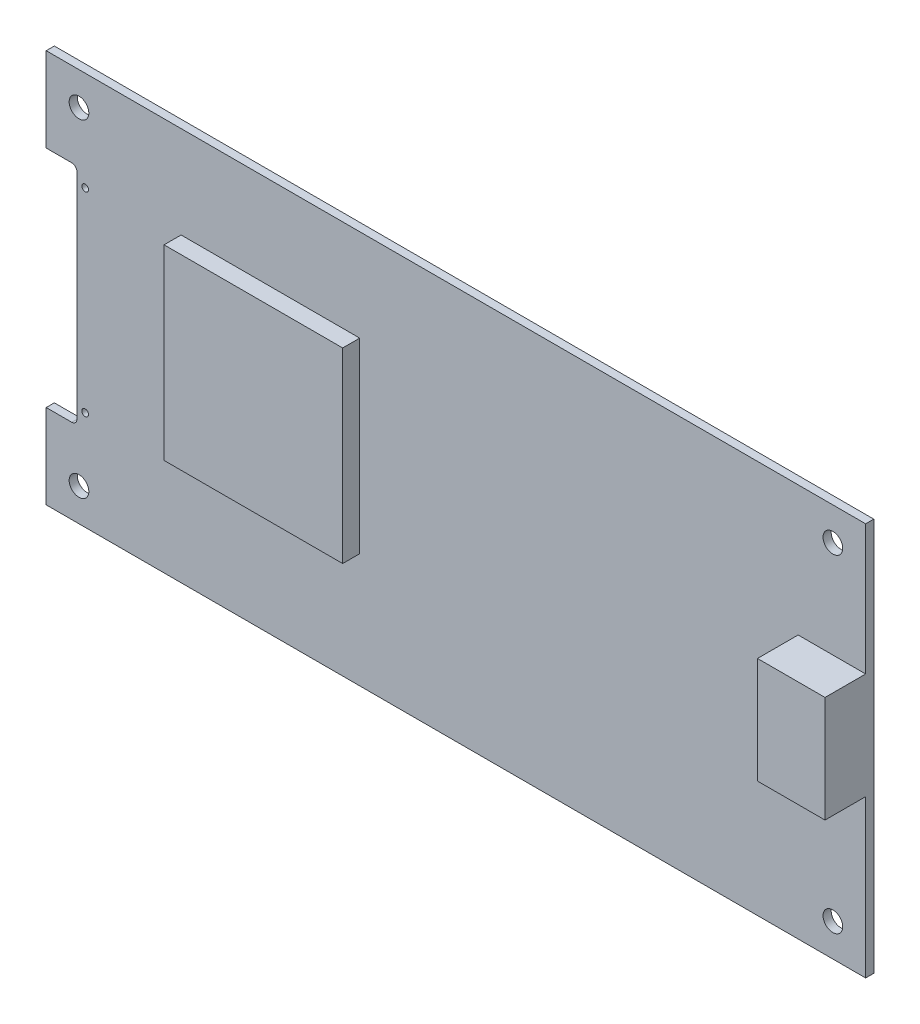
ISO-10303-21;
HEADER;
FILE_DESCRIPTION(('STEP AP214'),'2;1');
FILE_NAME('part.step','',(''),(''),'','','');
FILE_SCHEMA(('AUTOMOTIVE_DESIGN { 1 0 10303 214 1 1 1 1 }'));
ENDSEC;
DATA;
#1=APPLICATION_CONTEXT('core data for automotive mechanical design processes');
#2=APPLICATION_PROTOCOL_DEFINITION('international standard','automotive_design',2000,#1);
#3=PRODUCT_CONTEXT('',#1,'mechanical');
#4=PRODUCT('Part','Part','',(#3));
#5=PRODUCT_RELATED_PRODUCT_CATEGORY('part','',(#4));
#6=PRODUCT_DEFINITION_FORMATION('','',#4);
#7=PRODUCT_DEFINITION_CONTEXT('part definition',#1,'design');
#8=PRODUCT_DEFINITION('design','',#6,#7);
#9=PRODUCT_DEFINITION_SHAPE('','',#8);
#10=(LENGTH_UNIT() NAMED_UNIT(*) SI_UNIT(.MILLI.,.METRE.));
#11=(NAMED_UNIT(*) PLANE_ANGLE_UNIT() SI_UNIT($,.RADIAN.));
#12=(NAMED_UNIT(*) SI_UNIT($,.STERADIAN.) SOLID_ANGLE_UNIT());
#13=UNCERTAINTY_MEASURE_WITH_UNIT(LENGTH_MEASURE(1.E-05),#10,'distance_accuracy_value','');
#14=(GEOMETRIC_REPRESENTATION_CONTEXT(3) GLOBAL_UNCERTAINTY_ASSIGNED_CONTEXT((#13)) GLOBAL_UNIT_ASSIGNED_CONTEXT((#10,
#11,#12)) REPRESENTATION_CONTEXT('',''));
#15=CARTESIAN_POINT('',(0.,0.,0.));
#16=DIRECTION('',(0.,0.,1.));
#17=DIRECTION('',(1.,0.,0.));
#18=AXIS2_PLACEMENT_3D('',#15,#16,#17);
#19=CARTESIAN_POINT('',(158.75,-76.2,1.5748));
#20=DIRECTION('',(0.,0.,1.));
#21=DIRECTION('',(1.,0.,0.));
#22=AXIS2_PLACEMENT_3D('',#19,#20,#21);
#23=PLANE('',#22);
#24=DIRECTION('',(1.,0.,0.));
#25=VECTOR('',#24,1.);
#26=CARTESIAN_POINT('',(26.1339525283798,-54.0241486068111,1.5748));
#27=LINE('',#26,#25);
#28=CARTESIAN_POINT('',(26.1339525283798,-54.0241486068111,1.5748));
#29=VERTEX_POINT('',#28);
#30=CARTESIAN_POINT('',(60.7345717234262,-54.0241486068111,1.5748));
#31=VERTEX_POINT('',#30);
#32=EDGE_CURVE('E180',#29,#31,#27,.T.);
#33=ORIENTED_EDGE('',*,*,#32,.F.);
#34=DIRECTION('',(0.,-1.,0.));
#35=VECTOR('',#34,1.);
#36=CARTESIAN_POINT('',(26.1339525283798,-17.850773993808,1.5748));
#37=LINE('',#36,#35);
#38=CARTESIAN_POINT('',(26.1339525283798,-17.850773993808,1.5748));
#39=VERTEX_POINT('',#38);
#40=EDGE_CURVE('E177',#39,#29,#37,.T.);
#41=ORIENTED_EDGE('',*,*,#40,.F.);
#42=DIRECTION('',(-1.,0.,0.));
#43=VECTOR('',#42,1.);
#44=CARTESIAN_POINT('',(26.1339525283798,-17.850773993808,1.5748));
#45=LINE('',#44,#43);
#46=CARTESIAN_POINT('',(60.7345717234262,-17.850773993808,1.5748));
#47=VERTEX_POINT('',#46);
#48=EDGE_CURVE('E185',#47,#39,#45,.T.);
#49=ORIENTED_EDGE('',*,*,#48,.F.);
#50=DIRECTION('',(0.,1.,0.));
#51=VECTOR('',#50,1.);
#52=CARTESIAN_POINT('',(60.7345717234262,-17.850773993808,1.5748));
#53=LINE('',#52,#51);
#54=EDGE_CURVE('E182',#31,#47,#53,.T.);
#55=ORIENTED_EDGE('',*,*,#54,.F.);
#56=EDGE_LOOP('',(#33,#41,#49,#55));
#57=FACE_BOUND('',#56,.T.);
#58=CARTESIAN_POINT('',(7.55,-56.965088,1.5748));
#59=DIRECTION('',(0.,0.,1.));
#60=DIRECTION('',(1.,0.,0.));
#61=AXIS2_PLACEMENT_3D('',#58,#59,#60);
#62=CIRCLE('',#61,0.649999999999997);
#63=CARTESIAN_POINT('',(8.2,-56.965088,1.5748));
#64=VERTEX_POINT('',#63);
#65=EDGE_CURVE('E239',#64,#64,#62,.T.);
#66=ORIENTED_EDGE('',*,*,#65,.F.);
#67=EDGE_LOOP('',(#66));
#68=FACE_BOUND('',#67,.T.);
#69=CARTESIAN_POINT('',(7.55,-19.234912,1.5748));
#70=DIRECTION('',(0.,0.,1.));
#71=DIRECTION('',(1.,0.,0.));
#72=AXIS2_PLACEMENT_3D('',#69,#70,#71);
#73=CIRCLE('',#72,0.649999999999999);
#74=CARTESIAN_POINT('',(8.2,-19.234912,1.5748));
#75=VERTEX_POINT('',#74);
#76=EDGE_CURVE('E254',#75,#75,#73,.T.);
#77=ORIENTED_EDGE('',*,*,#76,.F.);
#78=EDGE_LOOP('',(#77));
#79=FACE_BOUND('',#78,.T.);
#80=CARTESIAN_POINT('',(6.35,-69.85,1.5748));
#81=DIRECTION('',(0.,0.,1.));
#82=DIRECTION('',(1.,0.,0.));
#83=AXIS2_PLACEMENT_3D('',#80,#81,#82);
#84=CIRCLE('',#83,1.905);
#85=CARTESIAN_POINT('',(8.255,-69.85,1.5748));
#86=VERTEX_POINT('',#85);
#87=EDGE_CURVE('E260',#86,#86,#84,.T.);
#88=ORIENTED_EDGE('',*,*,#87,.F.);
#89=EDGE_LOOP('',(#88));
#90=FACE_BOUND('',#89,.T.);
#91=CARTESIAN_POINT('',(152.4,-69.85,1.5748));
#92=DIRECTION('',(0.,0.,1.));
#93=DIRECTION('',(1.,0.,0.));
#94=AXIS2_PLACEMENT_3D('',#91,#92,#93);
#95=CIRCLE('',#94,1.90499999999999);
#96=CARTESIAN_POINT('',(154.305,-69.85,1.5748));
#97=VERTEX_POINT('',#96);
#98=EDGE_CURVE('E266',#97,#97,#95,.T.);
#99=ORIENTED_EDGE('',*,*,#98,.F.);
#100=EDGE_LOOP('',(#99));
#101=FACE_BOUND('',#100,.T.);
#102=CARTESIAN_POINT('',(6.34999999999999,-6.35,1.5748));
#103=DIRECTION('',(0.,0.,1.));
#104=DIRECTION('',(1.,0.,0.));
#105=AXIS2_PLACEMENT_3D('',#102,#103,#104);
#106=CIRCLE('',#105,1.905);
#107=CARTESIAN_POINT('',(8.255,-6.35,1.5748));
#108=VERTEX_POINT('',#107);
#109=EDGE_CURVE('E272',#108,#108,#106,.T.);
#110=ORIENTED_EDGE('',*,*,#109,.F.);
#111=EDGE_LOOP('',(#110));
#112=FACE_BOUND('',#111,.T.);
#113=CARTESIAN_POINT('',(152.4,-6.34999999999999,1.5748));
#114=DIRECTION('',(0.,0.,1.));
#115=DIRECTION('',(1.,0.,0.));
#116=AXIS2_PLACEMENT_3D('',#113,#114,#115);
#117=CIRCLE('',#116,1.90499999999999);
#118=CARTESIAN_POINT('',(154.305,-6.34999999999999,1.5748));
#119=VERTEX_POINT('',#118);
#120=EDGE_CURVE('E278',#119,#119,#117,.T.);
#121=ORIENTED_EDGE('',*,*,#120,.F.);
#122=EDGE_LOOP('',(#121));
#123=FACE_BOUND('',#122,.T.);
#124=DIRECTION('',(0.,1.,0.));
#125=VECTOR('',#124,1.);
#126=CARTESIAN_POINT('',(158.75,0.,1.5748));
#127=LINE('',#126,#125);
#128=CARTESIAN_POINT('',(158.75,-76.2,1.5748));
#129=VERTEX_POINT('',#128);
#130=CARTESIAN_POINT('',(158.75,-45.7671826625387,1.5748));
#131=VERTEX_POINT('',#130);
#132=EDGE_CURVE('E156',#129,#131,#127,.T.);
#133=ORIENTED_EDGE('',*,*,#132,.T.);
#134=DIRECTION('',(1.,0.,0.));
#135=VECTOR('',#134,1.);
#136=CARTESIAN_POINT('',(145.669,-45.7671826625387,1.5748));
#137=LINE('',#136,#135);
#138=CARTESIAN_POINT('',(145.669,-45.7671826625387,1.5748));
#139=VERTEX_POINT('',#138);
#140=EDGE_CURVE('E39',#139,#131,#137,.T.);
#141=ORIENTED_EDGE('',*,*,#140,.F.);
#142=DIRECTION('',(0.,-1.,0.));
#143=VECTOR('',#142,1.);
#144=CARTESIAN_POINT('',(145.669,-25.1931826625387,1.5748));
#145=LINE('',#144,#143);
#146=CARTESIAN_POINT('',(145.669,-25.1931826625387,1.5748));
#147=VERTEX_POINT('',#146);
#148=EDGE_CURVE('E44',#147,#139,#145,.T.);
#149=ORIENTED_EDGE('',*,*,#148,.F.);
#150=DIRECTION('',(-1.,0.,0.));
#151=VECTOR('',#150,1.);
#152=CARTESIAN_POINT('',(145.669,-25.1931826625387,1.5748));
#153=LINE('',#152,#151);
#154=CARTESIAN_POINT('',(158.75,-25.1931826625387,1.5748));
#155=VERTEX_POINT('',#154);
#156=EDGE_CURVE('E159',#155,#147,#153,.T.);
#157=ORIENTED_EDGE('',*,*,#156,.F.);
#158=CARTESIAN_POINT('',(158.75,0.,1.5748));
#159=VERTEX_POINT('',#158);
#160=EDGE_CURVE('E149',#155,#159,#127,.T.);
#161=ORIENTED_EDGE('',*,*,#160,.T.);
#162=DIRECTION('',(-1.,0.,0.));
#163=VECTOR('',#162,1.);
#164=CARTESIAN_POINT('',(0.,0.,1.5748));
#165=LINE('',#164,#163);
#166=CARTESIAN_POINT('',(0.,0.,1.5748));
#167=VERTEX_POINT('',#166);
#168=EDGE_CURVE('E293',#159,#167,#165,.T.);
#169=ORIENTED_EDGE('',*,*,#168,.T.);
#170=DIRECTION('',(0.,-1.,0.));
#171=VECTOR('',#170,1.);
#172=CARTESIAN_POINT('',(0.,0.,1.5748));
#173=LINE('',#172,#171);
#174=CARTESIAN_POINT('',(0.,-16.335006,1.5748));
#175=VERTEX_POINT('',#174);
#176=EDGE_CURVE('E296',#167,#175,#173,.T.);
#177=ORIENTED_EDGE('',*,*,#176,.T.);
#178=DIRECTION('',(-1.,0.,0.));
#179=VECTOR('',#178,1.);
#180=CARTESIAN_POINT('',(0.,-16.335006,1.5748));
#181=LINE('',#180,#179);
#182=CARTESIAN_POINT('',(4.95,-16.335006,1.5748));
#183=VERTEX_POINT('',#182);
#184=EDGE_CURVE('E218',#183,#175,#181,.T.);
#185=ORIENTED_EDGE('',*,*,#184,.F.);
#186=CARTESIAN_POINT('',(4.95,-17.335006,1.5748));
#187=DIRECTION('',(0.,0.,1.));
#188=DIRECTION('',(-1.,0.,0.));
#189=AXIS2_PLACEMENT_3D('',#186,#187,#188);
#190=CIRCLE('',#189,1.);
#191=CARTESIAN_POINT('',(5.95000000000001,-17.335006,1.5748));
#192=VERTEX_POINT('',#191);
#193=EDGE_CURVE('E215',#192,#183,#190,.T.);
#194=ORIENTED_EDGE('',*,*,#193,.F.);
#195=DIRECTION('',(0.,1.,0.));
#196=VECTOR('',#195,1.);
#197=CARTESIAN_POINT('',(5.95,-58.865006,1.5748));
#198=LINE('',#197,#196);
#199=CARTESIAN_POINT('',(5.95,-58.865006,1.5748));
#200=VERTEX_POINT('',#199);
#201=EDGE_CURVE('E212',#200,#192,#198,.T.);
#202=ORIENTED_EDGE('',*,*,#201,.F.);
#203=CARTESIAN_POINT('',(4.95,-58.865006,1.5748));
#204=DIRECTION('',(0.,0.,1.));
#205=DIRECTION('',(-1.,0.,0.));
#206=AXIS2_PLACEMENT_3D('',#203,#204,#205);
#207=CIRCLE('',#206,1.);
#208=CARTESIAN_POINT('',(4.95,-59.865006,1.5748));
#209=VERTEX_POINT('',#208);
#210=EDGE_CURVE('E209',#209,#200,#207,.T.);
#211=ORIENTED_EDGE('',*,*,#210,.F.);
#212=DIRECTION('',(1.,0.,0.));
#213=VECTOR('',#212,1.);
#214=CARTESIAN_POINT('',(0.,-59.865006,1.5748));
#215=LINE('',#214,#213);
#216=CARTESIAN_POINT('',(0.,-59.865006,1.5748));
#217=VERTEX_POINT('',#216);
#218=EDGE_CURVE('E206',#217,#209,#215,.T.);
#219=ORIENTED_EDGE('',*,*,#218,.F.);
#220=CARTESIAN_POINT('',(0.,-76.2,1.5748));
#221=VERTEX_POINT('',#220);
#222=EDGE_CURVE('E295',#217,#221,#173,.T.);
#223=ORIENTED_EDGE('',*,*,#222,.T.);
#224=DIRECTION('',(1.,0.,0.));
#225=VECTOR('',#224,1.);
#226=CARTESIAN_POINT('',(0.,-76.2,1.5748));
#227=LINE('',#226,#225);
#228=EDGE_CURVE('E299',#221,#129,#227,.T.);
#229=ORIENTED_EDGE('',*,*,#228,.T.);
#230=EDGE_LOOP('',(#133,#141,#149,#157,#161,#169,#177,#185,#194,#202,#211,#219,#223,#229));
#231=FACE_BOUND('',#230,.T.);
#232=ADVANCED_FACE('F24',(#57,#68,#79,#90,#101,#112,#123,#231),#23,.T.);
#233=CARTESIAN_POINT('',(0.,0.,1.5748));
#234=DIRECTION('',(1.,0.,0.));
#235=DIRECTION('',(0.,1.,0.));
#236=AXIS2_PLACEMENT_3D('',#233,#234,#235);
#237=PLANE('',#236);
#238=DIRECTION('',(0.,-1.,0.));
#239=VECTOR('',#238,1.);
#240=CARTESIAN_POINT('',(0.,0.,0.));
#241=LINE('',#240,#239);
#242=CARTESIAN_POINT('',(0.,0.,0.));
#243=VERTEX_POINT('',#242);
#244=CARTESIAN_POINT('',(0.,-16.335006,0.));
#245=VERTEX_POINT('',#244);
#246=EDGE_CURVE('E289',#243,#245,#241,.T.);
#247=ORIENTED_EDGE('',*,*,#246,.T.);
#248=DIRECTION('',(0.,0.,1.));
#249=VECTOR('',#248,1.);
#250=CARTESIAN_POINT('',(0.,-16.335006,0.));
#251=LINE('',#250,#249);
#252=EDGE_CURVE('E236',#245,#175,#251,.T.);
#253=ORIENTED_EDGE('',*,*,#252,.T.);
#254=ORIENTED_EDGE('',*,*,#176,.F.);
#255=DIRECTION('',(0.,0.,-1.));
#256=VECTOR('',#255,1.);
#257=CARTESIAN_POINT('',(0.,0.,1.5748));
#258=LINE('',#257,#256);
#259=EDGE_CURVE('E32',#167,#243,#258,.T.);
#260=ORIENTED_EDGE('',*,*,#259,.T.);
#261=EDGE_LOOP('',(#247,#253,#254,#260));
#262=FACE_BOUND('',#261,.T.);
#263=ADVANCED_FACE('F311',(#262),#237,.F.);
#264=CARTESIAN_POINT('',(158.75,0.,1.5748));
#265=DIRECTION('',(-1.,0.,0.));
#266=DIRECTION('',(0.,0.,1.));
#267=AXIS2_PLACEMENT_3D('',#264,#265,#266);
#268=PLANE('',#267);
#269=DIRECTION('',(0.,1.,0.));
#270=VECTOR('',#269,1.);
#271=CARTESIAN_POINT('',(158.75,0.,0.));
#272=LINE('',#271,#270);
#273=CARTESIAN_POINT('',(158.75,-76.2,0.));
#274=VERTEX_POINT('',#273);
#275=CARTESIAN_POINT('',(158.75,0.,0.));
#276=VERTEX_POINT('',#275);
#277=EDGE_CURVE('E284',#274,#276,#272,.T.);
#278=ORIENTED_EDGE('',*,*,#277,.T.);
#279=DIRECTION('',(0.,0.,-1.));
#280=VECTOR('',#279,1.);
#281=CARTESIAN_POINT('',(158.75,0.,1.5748));
#282=LINE('',#281,#280);
#283=EDGE_CURVE('E11',#159,#276,#282,.T.);
#284=ORIENTED_EDGE('',*,*,#283,.F.);
#285=ORIENTED_EDGE('',*,*,#160,.F.);
#286=DIRECTION('',(0.,0.,-1.));
#287=VECTOR('',#286,1.);
#288=CARTESIAN_POINT('',(158.75,-25.1931826625387,9.4488));
#289=LINE('',#288,#287);
#290=CARTESIAN_POINT('',(158.75,-25.1931826625387,9.4488));
#291=VERTEX_POINT('',#290);
#292=EDGE_CURVE('E153',#291,#155,#289,.T.);
#293=ORIENTED_EDGE('',*,*,#292,.F.);
#294=DIRECTION('',(0.,1.,0.));
#295=VECTOR('',#294,1.);
#296=CARTESIAN_POINT('',(158.75,-25.1931826625387,9.4488));
#297=LINE('',#296,#295);
#298=CARTESIAN_POINT('',(158.75,-45.7671826625387,9.4488));
#299=VERTEX_POINT('',#298);
#300=EDGE_CURVE('E586',#299,#291,#297,.T.);
#301=ORIENTED_EDGE('',*,*,#300,.F.);
#302=DIRECTION('',(0.,0.,-1.));
#303=VECTOR('',#302,1.);
#304=CARTESIAN_POINT('',(158.75,-45.7671826625387,9.4488));
#305=LINE('',#304,#303);
#306=EDGE_CURVE('E167',#299,#131,#305,.T.);
#307=ORIENTED_EDGE('',*,*,#306,.T.);
#308=ORIENTED_EDGE('',*,*,#132,.F.);
#309=DIRECTION('',(0.,0.,-1.));
#310=VECTOR('',#309,1.);
#311=CARTESIAN_POINT('',(158.75,-76.2,1.5748));
#312=LINE('',#311,#310);
#313=EDGE_CURVE('E301',#129,#274,#312,.T.);
#314=ORIENTED_EDGE('',*,*,#313,.T.);
#315=EDGE_LOOP('',(#278,#284,#285,#293,#301,#307,#308,#314));
#316=FACE_BOUND('',#315,.T.);
#317=ADVANCED_FACE('F26',(#316),#268,.F.);
#318=CARTESIAN_POINT('',(0.,0.,1.5748));
#319=DIRECTION('',(0.,-1.,0.));
#320=DIRECTION('',(0.,0.,-1.));
#321=AXIS2_PLACEMENT_3D('',#318,#319,#320);
#322=PLANE('',#321);
#323=DIRECTION('',(-1.,0.,0.));
#324=VECTOR('',#323,1.);
#325=CARTESIAN_POINT('',(0.,0.,0.));
#326=LINE('',#325,#324);
#327=EDGE_CURVE('E286',#276,#243,#326,.T.);
#328=ORIENTED_EDGE('',*,*,#327,.T.);
#329=ORIENTED_EDGE('',*,*,#259,.F.);
#330=ORIENTED_EDGE('',*,*,#168,.F.);
#331=ORIENTED_EDGE('',*,*,#283,.T.);
#332=EDGE_LOOP('',(#328,#329,#330,#331));
#333=FACE_BOUND('',#332,.T.);
#334=ADVANCED_FACE('F322',(#333),#322,.F.);
#335=ORIENTED_EDGE('',*,*,#222,.F.);
#336=DIRECTION('',(0.,0.,1.));
#337=VECTOR('',#336,1.);
#338=CARTESIAN_POINT('',(0.,-59.865006,0.));
#339=LINE('',#338,#337);
#340=CARTESIAN_POINT('',(0.,-59.865006,0.));
#341=VERTEX_POINT('',#340);
#342=EDGE_CURVE('E235',#341,#217,#339,.T.);
#343=ORIENTED_EDGE('',*,*,#342,.F.);
#344=CARTESIAN_POINT('',(0.,-76.2,0.));
#345=VERTEX_POINT('',#344);
#346=EDGE_CURVE('E288',#341,#345,#241,.T.);
#347=ORIENTED_EDGE('',*,*,#346,.T.);
#348=DIRECTION('',(0.,0.,-1.));
#349=VECTOR('',#348,1.);
#350=CARTESIAN_POINT('',(0.,-76.2,1.5748));
#351=LINE('',#350,#349);
#352=EDGE_CURVE('E304',#221,#345,#351,.T.);
#353=ORIENTED_EDGE('',*,*,#352,.F.);
#354=EDGE_LOOP('',(#335,#343,#347,#353));
#355=FACE_BOUND('',#354,.T.);
#356=ADVANCED_FACE('F333',(#355),#237,.F.);
#357=CARTESIAN_POINT('',(0.,-76.2,1.5748));
#358=DIRECTION('',(0.,1.,0.));
#359=DIRECTION('',(0.,0.,1.));
#360=AXIS2_PLACEMENT_3D('',#357,#358,#359);
#361=PLANE('',#360);
#362=DIRECTION('',(1.,0.,0.));
#363=VECTOR('',#362,1.);
#364=CARTESIAN_POINT('',(0.,-76.2,0.));
#365=LINE('',#364,#363);
#366=EDGE_CURVE('E157',#345,#274,#365,.T.);
#367=ORIENTED_EDGE('',*,*,#366,.T.);
#368=ORIENTED_EDGE('',*,*,#313,.F.);
#369=ORIENTED_EDGE('',*,*,#228,.F.);
#370=ORIENTED_EDGE('',*,*,#352,.T.);
#371=EDGE_LOOP('',(#367,#368,#369,#370));
#372=FACE_BOUND('',#371,.T.);
#373=ADVANCED_FACE('F328',(#372),#361,.F.);
#374=CARTESIAN_POINT('',(158.75,-76.2,0.));
#375=DIRECTION('',(0.,0.,1.));
#376=DIRECTION('',(1.,0.,0.));
#377=AXIS2_PLACEMENT_3D('',#374,#375,#376);
#378=PLANE('',#377);
#379=CARTESIAN_POINT('',(7.55,-56.965088,0.));
#380=DIRECTION('',(0.,0.,1.));
#381=DIRECTION('',(1.,0.,0.));
#382=AXIS2_PLACEMENT_3D('',#379,#380,#381);
#383=CIRCLE('',#382,0.649999999999997);
#384=CARTESIAN_POINT('',(8.2,-56.965088,0.));
#385=VERTEX_POINT('',#384);
#386=EDGE_CURVE('E251',#385,#385,#383,.T.);
#387=ORIENTED_EDGE('',*,*,#386,.T.);
#388=EDGE_LOOP('',(#387));
#389=FACE_BOUND('',#388,.T.);
#390=CARTESIAN_POINT('',(7.55,-19.234912,0.));
#391=DIRECTION('',(0.,0.,1.));
#392=DIRECTION('',(1.,0.,0.));
#393=AXIS2_PLACEMENT_3D('',#390,#391,#392);
#394=CIRCLE('',#393,0.649999999999999);
#395=CARTESIAN_POINT('',(8.2,-19.234912,0.));
#396=VERTEX_POINT('',#395);
#397=EDGE_CURVE('E257',#396,#396,#394,.T.);
#398=ORIENTED_EDGE('',*,*,#397,.T.);
#399=EDGE_LOOP('',(#398));
#400=FACE_BOUND('',#399,.T.);
#401=CARTESIAN_POINT('',(6.35,-69.85,0.));
#402=DIRECTION('',(0.,0.,1.));
#403=DIRECTION('',(1.,0.,0.));
#404=AXIS2_PLACEMENT_3D('',#401,#402,#403);
#405=CIRCLE('',#404,1.905);
#406=CARTESIAN_POINT('',(8.255,-69.85,0.));
#407=VERTEX_POINT('',#406);
#408=EDGE_CURVE('E263',#407,#407,#405,.T.);
#409=ORIENTED_EDGE('',*,*,#408,.T.);
#410=EDGE_LOOP('',(#409));
#411=FACE_BOUND('',#410,.T.);
#412=CARTESIAN_POINT('',(152.4,-69.85,0.));
#413=DIRECTION('',(0.,0.,1.));
#414=DIRECTION('',(1.,0.,0.));
#415=AXIS2_PLACEMENT_3D('',#412,#413,#414);
#416=CIRCLE('',#415,1.90499999999999);
#417=CARTESIAN_POINT('',(154.305,-69.85,0.));
#418=VERTEX_POINT('',#417);
#419=EDGE_CURVE('E269',#418,#418,#416,.T.);
#420=ORIENTED_EDGE('',*,*,#419,.T.);
#421=EDGE_LOOP('',(#420));
#422=FACE_BOUND('',#421,.T.);
#423=CARTESIAN_POINT('',(6.34999999999999,-6.35,0.));
#424=DIRECTION('',(0.,0.,1.));
#425=DIRECTION('',(1.,0.,0.));
#426=AXIS2_PLACEMENT_3D('',#423,#424,#425);
#427=CIRCLE('',#426,1.905);
#428=CARTESIAN_POINT('',(8.255,-6.35,0.));
#429=VERTEX_POINT('',#428);
#430=EDGE_CURVE('E275',#429,#429,#427,.T.);
#431=ORIENTED_EDGE('',*,*,#430,.T.);
#432=EDGE_LOOP('',(#431));
#433=FACE_BOUND('',#432,.T.);
#434=CARTESIAN_POINT('',(152.4,-6.34999999999999,0.));
#435=DIRECTION('',(0.,0.,1.));
#436=DIRECTION('',(1.,0.,0.));
#437=AXIS2_PLACEMENT_3D('',#434,#435,#436);
#438=CIRCLE('',#437,1.90499999999999);
#439=CARTESIAN_POINT('',(154.305,-6.34999999999999,0.));
#440=VERTEX_POINT('',#439);
#441=EDGE_CURVE('E281',#440,#440,#438,.T.);
#442=ORIENTED_EDGE('',*,*,#441,.T.);
#443=EDGE_LOOP('',(#442));
#444=FACE_BOUND('',#443,.T.);
#445=CARTESIAN_POINT('',(4.95,-17.335006,0.));
#446=DIRECTION('',(0.,0.,1.));
#447=DIRECTION('',(-1.,0.,0.));
#448=AXIS2_PLACEMENT_3D('',#445,#446,#447);
#449=CIRCLE('',#448,1.);
#450=CARTESIAN_POINT('',(5.95000000000001,-17.335006,0.));
#451=VERTEX_POINT('',#450);
#452=CARTESIAN_POINT('',(4.95,-16.335006,0.));
#453=VERTEX_POINT('',#452);
#454=EDGE_CURVE('E229',#451,#453,#449,.T.);
#455=ORIENTED_EDGE('',*,*,#454,.T.);
#456=DIRECTION('',(-1.,0.,0.));
#457=VECTOR('',#456,1.);
#458=CARTESIAN_POINT('',(0.,-16.335006,0.));
#459=LINE('',#458,#457);
#460=EDGE_CURVE('E232',#453,#245,#459,.T.);
#461=ORIENTED_EDGE('',*,*,#460,.T.);
#462=ORIENTED_EDGE('',*,*,#246,.F.);
#463=ORIENTED_EDGE('',*,*,#327,.F.);
#464=ORIENTED_EDGE('',*,*,#277,.F.);
#465=ORIENTED_EDGE('',*,*,#366,.F.);
#466=ORIENTED_EDGE('',*,*,#346,.F.);
#467=DIRECTION('',(1.,0.,0.));
#468=VECTOR('',#467,1.);
#469=CARTESIAN_POINT('',(0.,-59.865006,0.));
#470=LINE('',#469,#468);
#471=CARTESIAN_POINT('',(4.95000000000001,-59.865006,0.));
#472=VERTEX_POINT('',#471);
#473=EDGE_CURVE('E220',#341,#472,#470,.T.);
#474=ORIENTED_EDGE('',*,*,#473,.T.);
#475=CARTESIAN_POINT('',(4.95,-58.865006,0.));
#476=DIRECTION('',(0.,0.,1.));
#477=DIRECTION('',(-1.,0.,0.));
#478=AXIS2_PLACEMENT_3D('',#475,#476,#477);
#479=CIRCLE('',#478,1.);
#480=CARTESIAN_POINT('',(5.95,-58.865006,0.));
#481=VERTEX_POINT('',#480);
#482=EDGE_CURVE('E223',#472,#481,#479,.T.);
#483=ORIENTED_EDGE('',*,*,#482,.T.);
#484=DIRECTION('',(0.,1.,0.));
#485=VECTOR('',#484,1.);
#486=CARTESIAN_POINT('',(5.95,-58.865006,0.));
#487=LINE('',#486,#485);
#488=EDGE_CURVE('E226',#481,#451,#487,.T.);
#489=ORIENTED_EDGE('',*,*,#488,.T.);
#490=EDGE_LOOP('',(#455,#461,#462,#463,#464,#465,#466,#474,#483,#489));
#491=FACE_BOUND('',#490,.T.);
#492=ADVANCED_FACE('F314',(#389,#400,#411,#422,#433,#444,#491),#378,.F.);
#493=CARTESIAN_POINT('',(152.4,-6.34999999999999,0.));
#494=DIRECTION('',(0.,0.,1.));
#495=DIRECTION('',(1.,0.,0.));
#496=AXIS2_PLACEMENT_3D('',#493,#494,#495);
#497=CYLINDRICAL_SURFACE('',#496,1.90499999999999);
#498=ORIENTED_EDGE('',*,*,#441,.F.);
#499=EDGE_LOOP('',(#498));
#500=FACE_BOUND('',#499,.T.);
#501=ORIENTED_EDGE('',*,*,#120,.T.);
#502=EDGE_LOOP('',(#501));
#503=FACE_BOUND('',#502,.T.);
#504=ADVANCED_FACE('F467',(#500,#503),#497,.F.);
#505=CARTESIAN_POINT('',(6.34999999999999,-6.35,0.));
#506=DIRECTION('',(0.,0.,1.));
#507=DIRECTION('',(1.,0.,0.));
#508=AXIS2_PLACEMENT_3D('',#505,#506,#507);
#509=CYLINDRICAL_SURFACE('',#508,1.905);
#510=ORIENTED_EDGE('',*,*,#430,.F.);
#511=EDGE_LOOP('',(#510));
#512=FACE_BOUND('',#511,.T.);
#513=ORIENTED_EDGE('',*,*,#109,.T.);
#514=EDGE_LOOP('',(#513));
#515=FACE_BOUND('',#514,.T.);
#516=ADVANCED_FACE('F464',(#512,#515),#509,.F.);
#517=CARTESIAN_POINT('',(152.4,-69.85,0.));
#518=DIRECTION('',(0.,0.,1.));
#519=DIRECTION('',(1.,0.,0.));
#520=AXIS2_PLACEMENT_3D('',#517,#518,#519);
#521=CYLINDRICAL_SURFACE('',#520,1.90499999999999);
#522=ORIENTED_EDGE('',*,*,#419,.F.);
#523=EDGE_LOOP('',(#522));
#524=FACE_BOUND('',#523,.T.);
#525=ORIENTED_EDGE('',*,*,#98,.T.);
#526=EDGE_LOOP('',(#525));
#527=FACE_BOUND('',#526,.T.);
#528=ADVANCED_FACE('F460',(#524,#527),#521,.F.);
#529=CARTESIAN_POINT('',(6.35,-69.85,0.));
#530=DIRECTION('',(0.,0.,1.));
#531=DIRECTION('',(1.,0.,0.));
#532=AXIS2_PLACEMENT_3D('',#529,#530,#531);
#533=CYLINDRICAL_SURFACE('',#532,1.905);
#534=ORIENTED_EDGE('',*,*,#408,.F.);
#535=EDGE_LOOP('',(#534));
#536=FACE_BOUND('',#535,.T.);
#537=ORIENTED_EDGE('',*,*,#87,.T.);
#538=EDGE_LOOP('',(#537));
#539=FACE_BOUND('',#538,.T.);
#540=ADVANCED_FACE('F456',(#536,#539),#533,.F.);
#541=CARTESIAN_POINT('',(7.55,-19.234912,0.));
#542=DIRECTION('',(0.,0.,1.));
#543=DIRECTION('',(1.,0.,0.));
#544=AXIS2_PLACEMENT_3D('',#541,#542,#543);
#545=CYLINDRICAL_SURFACE('',#544,0.649999999999999);
#546=ORIENTED_EDGE('',*,*,#397,.F.);
#547=EDGE_LOOP('',(#546));
#548=FACE_BOUND('',#547,.T.);
#549=ORIENTED_EDGE('',*,*,#76,.T.);
#550=EDGE_LOOP('',(#549));
#551=FACE_BOUND('',#550,.T.);
#552=ADVANCED_FACE('F452',(#548,#551),#545,.F.);
#553=CARTESIAN_POINT('',(7.55,-56.965088,0.));
#554=DIRECTION('',(0.,0.,1.));
#555=DIRECTION('',(1.,0.,0.));
#556=AXIS2_PLACEMENT_3D('',#553,#554,#555);
#557=CYLINDRICAL_SURFACE('',#556,0.649999999999997);
#558=ORIENTED_EDGE('',*,*,#386,.F.);
#559=EDGE_LOOP('',(#558));
#560=FACE_BOUND('',#559,.T.);
#561=ORIENTED_EDGE('',*,*,#65,.T.);
#562=EDGE_LOOP('',(#561));
#563=FACE_BOUND('',#562,.T.);
#564=ADVANCED_FACE('F355',(#560,#563),#557,.F.);
#565=CARTESIAN_POINT('',(0.,-16.335006,0.));
#566=DIRECTION('',(0.,1.,0.));
#567=DIRECTION('',(0.,0.,1.));
#568=AXIS2_PLACEMENT_3D('',#565,#566,#567);
#569=PLANE('',#568);
#570=ORIENTED_EDGE('',*,*,#184,.T.);
#571=ORIENTED_EDGE('',*,*,#252,.F.);
#572=ORIENTED_EDGE('',*,*,#460,.F.);
#573=DIRECTION('',(0.,0.,1.));
#574=VECTOR('',#573,1.);
#575=CARTESIAN_POINT('',(4.95,-16.335006,0.));
#576=LINE('',#575,#574);
#577=EDGE_CURVE('E240',#453,#183,#576,.T.);
#578=ORIENTED_EDGE('',*,*,#577,.T.);
#579=EDGE_LOOP('',(#570,#571,#572,#578));
#580=FACE_BOUND('',#579,.T.);
#581=ADVANCED_FACE('F319',(#580),#569,.F.);
#582=CARTESIAN_POINT('',(4.95,-17.335006,0.));
#583=DIRECTION('',(0.,0.,1.));
#584=DIRECTION('',(1.,0.,0.));
#585=AXIS2_PLACEMENT_3D('',#582,#583,#584);
#586=CYLINDRICAL_SURFACE('',#585,1.);
#587=ORIENTED_EDGE('',*,*,#193,.T.);
#588=ORIENTED_EDGE('',*,*,#577,.F.);
#589=ORIENTED_EDGE('',*,*,#454,.F.);
#590=DIRECTION('',(0.,0.,1.));
#591=VECTOR('',#590,1.);
#592=CARTESIAN_POINT('',(5.95000000000001,-17.335006,0.));
#593=LINE('',#592,#591);
#594=EDGE_CURVE('E242',#451,#192,#593,.T.);
#595=ORIENTED_EDGE('',*,*,#594,.T.);
#596=EDGE_LOOP('',(#587,#588,#589,#595));
#597=FACE_BOUND('',#596,.T.);
#598=ADVANCED_FACE('F347',(#597),#586,.F.);
#599=CARTESIAN_POINT('',(5.95,-58.865006,0.));
#600=DIRECTION('',(1.,0.,0.));
#601=DIRECTION('',(0.,1.,0.));
#602=AXIS2_PLACEMENT_3D('',#599,#600,#601);
#603=PLANE('',#602);
#604=ORIENTED_EDGE('',*,*,#201,.T.);
#605=ORIENTED_EDGE('',*,*,#594,.F.);
#606=ORIENTED_EDGE('',*,*,#488,.F.);
#607=DIRECTION('',(0.,0.,1.));
#608=VECTOR('',#607,1.);
#609=CARTESIAN_POINT('',(5.95,-58.865006,0.));
#610=LINE('',#609,#608);
#611=EDGE_CURVE('E244',#481,#200,#610,.T.);
#612=ORIENTED_EDGE('',*,*,#611,.T.);
#613=EDGE_LOOP('',(#604,#605,#606,#612));
#614=FACE_BOUND('',#613,.T.);
#615=ADVANCED_FACE('F345',(#614),#603,.F.);
#616=CARTESIAN_POINT('',(4.95,-58.865006,0.));
#617=DIRECTION('',(0.,0.,1.));
#618=DIRECTION('',(1.,0.,0.));
#619=AXIS2_PLACEMENT_3D('',#616,#617,#618);
#620=CYLINDRICAL_SURFACE('',#619,1.);
#621=ORIENTED_EDGE('',*,*,#210,.T.);
#622=ORIENTED_EDGE('',*,*,#611,.F.);
#623=ORIENTED_EDGE('',*,*,#482,.F.);
#624=DIRECTION('',(0.,0.,1.));
#625=VECTOR('',#624,1.);
#626=CARTESIAN_POINT('',(4.95,-59.865006,0.));
#627=LINE('',#626,#625);
#628=EDGE_CURVE('E246',#472,#209,#627,.T.);
#629=ORIENTED_EDGE('',*,*,#628,.T.);
#630=EDGE_LOOP('',(#621,#622,#623,#629));
#631=FACE_BOUND('',#630,.T.);
#632=ADVANCED_FACE('F342',(#631),#620,.F.);
#633=CARTESIAN_POINT('',(0.,-59.865006,0.));
#634=DIRECTION('',(0.,-1.,0.));
#635=DIRECTION('',(0.,0.,-1.));
#636=AXIS2_PLACEMENT_3D('',#633,#634,#635);
#637=PLANE('',#636);
#638=ORIENTED_EDGE('',*,*,#218,.T.);
#639=ORIENTED_EDGE('',*,*,#628,.F.);
#640=ORIENTED_EDGE('',*,*,#473,.F.);
#641=ORIENTED_EDGE('',*,*,#342,.T.);
#642=EDGE_LOOP('',(#638,#639,#640,#641));
#643=FACE_BOUND('',#642,.T.);
#644=ADVANCED_FACE('F337',(#643),#637,.F.);
#645=CARTESIAN_POINT('',(26.1339525283798,-17.850773993808,4.8768));
#646=DIRECTION('',(1.,0.,0.));
#647=DIRECTION('',(0.,0.,-1.));
#648=AXIS2_PLACEMENT_3D('',#645,#646,#647);
#649=PLANE('',#648);
#650=ORIENTED_EDGE('',*,*,#40,.T.);
#651=DIRECTION('',(0.,0.,-1.));
#652=VECTOR('',#651,1.);
#653=CARTESIAN_POINT('',(26.1339525283798,-54.0241486068111,4.8768));
#654=LINE('',#653,#652);
#655=CARTESIAN_POINT('',(26.1339525283798,-54.0241486068111,4.8768));
#656=VERTEX_POINT('',#655);
#657=EDGE_CURVE('E204',#656,#29,#654,.T.);
#658=ORIENTED_EDGE('',*,*,#657,.F.);
#659=DIRECTION('',(0.,-1.,0.));
#660=VECTOR('',#659,1.);
#661=CARTESIAN_POINT('',(26.1339525283798,-17.850773993808,4.8768));
#662=LINE('',#661,#660);
#663=CARTESIAN_POINT('',(26.1339525283798,-17.850773993808,4.8768));
#664=VERTEX_POINT('',#663);
#665=EDGE_CURVE('E187',#664,#656,#662,.T.);
#666=ORIENTED_EDGE('',*,*,#665,.F.);
#667=DIRECTION('',(0.,0.,-1.));
#668=VECTOR('',#667,1.);
#669=CARTESIAN_POINT('',(26.1339525283798,-17.850773993808,4.8768));
#670=LINE('',#669,#668);
#671=EDGE_CURVE('E196',#664,#39,#670,.T.);
#672=ORIENTED_EDGE('',*,*,#671,.T.);
#673=EDGE_LOOP('',(#650,#658,#666,#672));
#674=FACE_BOUND('',#673,.T.);
#675=ADVANCED_FACE('F427',(#674),#649,.F.);
#676=CARTESIAN_POINT('',(26.1339525283798,-54.0241486068111,4.8768));
#677=DIRECTION('',(0.,1.,0.));
#678=DIRECTION('',(0.,0.,1.));
#679=AXIS2_PLACEMENT_3D('',#676,#677,#678);
#680=PLANE('',#679);
#681=ORIENTED_EDGE('',*,*,#32,.T.);
#682=DIRECTION('',(0.,0.,-1.));
#683=VECTOR('',#682,1.);
#684=CARTESIAN_POINT('',(60.7345717234262,-54.0241486068111,4.8768));
#685=LINE('',#684,#683);
#686=CARTESIAN_POINT('',(60.7345717234262,-54.0241486068111,4.8768));
#687=VERTEX_POINT('',#686);
#688=EDGE_CURVE('E201',#687,#31,#685,.T.);
#689=ORIENTED_EDGE('',*,*,#688,.F.);
#690=DIRECTION('',(1.,0.,0.));
#691=VECTOR('',#690,1.);
#692=CARTESIAN_POINT('',(26.1339525283798,-54.0241486068111,4.8768));
#693=LINE('',#692,#691);
#694=EDGE_CURVE('E190',#656,#687,#693,.T.);
#695=ORIENTED_EDGE('',*,*,#694,.F.);
#696=ORIENTED_EDGE('',*,*,#657,.T.);
#697=EDGE_LOOP('',(#681,#689,#695,#696));
#698=FACE_BOUND('',#697,.T.);
#699=ADVANCED_FACE('F423',(#698),#680,.F.);
#700=CARTESIAN_POINT('',(60.7345717234262,-17.850773993808,4.8768));
#701=DIRECTION('',(-1.,0.,0.));
#702=DIRECTION('',(0.,0.,1.));
#703=AXIS2_PLACEMENT_3D('',#700,#701,#702);
#704=PLANE('',#703);
#705=ORIENTED_EDGE('',*,*,#54,.T.);
#706=DIRECTION('',(0.,0.,-1.));
#707=VECTOR('',#706,1.);
#708=CARTESIAN_POINT('',(60.7345717234262,-17.850773993808,4.8768));
#709=LINE('',#708,#707);
#710=CARTESIAN_POINT('',(60.7345717234262,-17.850773993808,4.8768));
#711=VERTEX_POINT('',#710);
#712=EDGE_CURVE('E199',#711,#47,#709,.T.);
#713=ORIENTED_EDGE('',*,*,#712,.F.);
#714=DIRECTION('',(0.,1.,0.));
#715=VECTOR('',#714,1.);
#716=CARTESIAN_POINT('',(60.7345717234262,-17.850773993808,4.8768));
#717=LINE('',#716,#715);
#718=EDGE_CURVE('E192',#687,#711,#717,.T.);
#719=ORIENTED_EDGE('',*,*,#718,.F.);
#720=ORIENTED_EDGE('',*,*,#688,.T.);
#721=EDGE_LOOP('',(#705,#713,#719,#720));
#722=FACE_BOUND('',#721,.T.);
#723=ADVANCED_FACE('F419',(#722),#704,.F.);
#724=CARTESIAN_POINT('',(26.1339525283798,-17.850773993808,4.8768));
#725=DIRECTION('',(0.,-1.,0.));
#726=DIRECTION('',(0.,0.,-1.));
#727=AXIS2_PLACEMENT_3D('',#724,#725,#726);
#728=PLANE('',#727);
#729=ORIENTED_EDGE('',*,*,#48,.T.);
#730=ORIENTED_EDGE('',*,*,#671,.F.);
#731=DIRECTION('',(-1.,0.,0.));
#732=VECTOR('',#731,1.);
#733=CARTESIAN_POINT('',(26.1339525283798,-17.850773993808,4.8768));
#734=LINE('',#733,#732);
#735=EDGE_CURVE('E194',#711,#664,#734,.T.);
#736=ORIENTED_EDGE('',*,*,#735,.F.);
#737=ORIENTED_EDGE('',*,*,#712,.T.);
#738=EDGE_LOOP('',(#729,#730,#736,#737));
#739=FACE_BOUND('',#738,.T.);
#740=ADVANCED_FACE('F415',(#739),#728,.F.);
#741=CARTESIAN_POINT('',(26.1339525283798,-54.0241486068111,4.8768));
#742=DIRECTION('',(0.,0.,1.));
#743=DIRECTION('',(1.,0.,0.));
#744=AXIS2_PLACEMENT_3D('',#741,#742,#743);
#745=PLANE('',#744);
#746=ORIENTED_EDGE('',*,*,#665,.T.);
#747=ORIENTED_EDGE('',*,*,#694,.T.);
#748=ORIENTED_EDGE('',*,*,#718,.T.);
#749=ORIENTED_EDGE('',*,*,#735,.T.);
#750=EDGE_LOOP('',(#746,#747,#748,#749));
#751=FACE_BOUND('',#750,.T.);
#752=ADVANCED_FACE('F387',(#751),#745,.T.);
#753=CARTESIAN_POINT('',(145.669,-25.1931826625387,9.4488));
#754=DIRECTION('',(1.,0.,0.));
#755=DIRECTION('',(0.,0.,-1.));
#756=AXIS2_PLACEMENT_3D('',#753,#754,#755);
#757=PLANE('',#756);
#758=ORIENTED_EDGE('',*,*,#148,.T.);
#759=DIRECTION('',(0.,0.,-1.));
#760=VECTOR('',#759,1.);
#761=CARTESIAN_POINT('',(145.669,-45.7671826625387,9.4488));
#762=LINE('',#761,#760);
#763=CARTESIAN_POINT('',(145.669,-45.7671826625387,9.4488));
#764=VERTEX_POINT('',#763);
#765=EDGE_CURVE('E171',#764,#139,#762,.T.);
#766=ORIENTED_EDGE('',*,*,#765,.F.);
#767=DIRECTION('',(0.,-1.,0.));
#768=VECTOR('',#767,1.);
#769=CARTESIAN_POINT('',(145.669,-25.1931826625387,9.4488));
#770=LINE('',#769,#768);
#771=CARTESIAN_POINT('',(145.669,-25.1931826625387,9.4488));
#772=VERTEX_POINT('',#771);
#773=EDGE_CURVE('E163',#772,#764,#770,.T.);
#774=ORIENTED_EDGE('',*,*,#773,.F.);
#775=DIRECTION('',(0.,0.,-1.));
#776=VECTOR('',#775,1.);
#777=CARTESIAN_POINT('',(145.669,-25.1931826625387,9.4488));
#778=LINE('',#777,#776);
#779=EDGE_CURVE('E168',#772,#147,#778,.T.);
#780=ORIENTED_EDGE('',*,*,#779,.T.);
#781=EDGE_LOOP('',(#758,#766,#774,#780));
#782=FACE_BOUND('',#781,.T.);
#783=ADVANCED_FACE('F383',(#782),#757,.F.);
#784=CARTESIAN_POINT('',(145.669,-45.7671826625387,9.4488));
#785=DIRECTION('',(0.,1.,0.));
#786=DIRECTION('',(0.,0.,1.));
#787=AXIS2_PLACEMENT_3D('',#784,#785,#786);
#788=PLANE('',#787);
#789=ORIENTED_EDGE('',*,*,#140,.T.);
#790=ORIENTED_EDGE('',*,*,#306,.F.);
#791=DIRECTION('',(1.,0.,0.));
#792=VECTOR('',#791,1.);
#793=CARTESIAN_POINT('',(145.669,-45.7671826625387,9.4488));
#794=LINE('',#793,#792);
#795=EDGE_CURVE('E583',#764,#299,#794,.T.);
#796=ORIENTED_EDGE('',*,*,#795,.F.);
#797=ORIENTED_EDGE('',*,*,#765,.T.);
#798=EDGE_LOOP('',(#789,#790,#796,#797));
#799=FACE_BOUND('',#798,.T.);
#800=ADVANCED_FACE('F386',(#799),#788,.F.);
#801=CARTESIAN_POINT('',(145.669,-25.1931826625387,9.4488));
#802=DIRECTION('',(0.,-1.,0.));
#803=DIRECTION('',(0.,0.,-1.));
#804=AXIS2_PLACEMENT_3D('',#801,#802,#803);
#805=PLANE('',#804);
#806=ORIENTED_EDGE('',*,*,#156,.T.);
#807=ORIENTED_EDGE('',*,*,#779,.F.);
#808=DIRECTION('',(-1.,0.,0.));
#809=VECTOR('',#808,1.);
#810=CARTESIAN_POINT('',(145.669,-25.1931826625387,9.4488));
#811=LINE('',#810,#809);
#812=EDGE_CURVE('E166',#291,#772,#811,.T.);
#813=ORIENTED_EDGE('',*,*,#812,.F.);
#814=ORIENTED_EDGE('',*,*,#292,.T.);
#815=EDGE_LOOP('',(#806,#807,#813,#814));
#816=FACE_BOUND('',#815,.T.);
#817=ADVANCED_FACE('F165',(#816),#805,.F.);
#818=CARTESIAN_POINT('',(145.669,-45.7671826625387,9.4488));
#819=DIRECTION('',(0.,0.,1.));
#820=DIRECTION('',(1.,0.,0.));
#821=AXIS2_PLACEMENT_3D('',#818,#819,#820);
#822=PLANE('',#821);
#823=ORIENTED_EDGE('',*,*,#773,.T.);
#824=ORIENTED_EDGE('',*,*,#795,.T.);
#825=ORIENTED_EDGE('',*,*,#300,.T.);
#826=ORIENTED_EDGE('',*,*,#812,.T.);
#827=EDGE_LOOP('',(#823,#824,#825,#826));
#828=FACE_BOUND('',#827,.T.);
#829=ADVANCED_FACE('F402',(#828),#822,.T.);
#830=CLOSED_SHELL('',(#232,#263,#317,#334,#356,#373,#492,#504,#516,#528,#540,#552,#564,#581,
#598,#615,#632,#644,#675,#699,#723,#740,#752,#783,#800,#817,#829));
#831=MANIFOLD_SOLID_BREP('B2',#830);
#832=ADVANCED_BREP_SHAPE_REPRESENTATION('',(#18,#831),#14);
#833=SHAPE_DEFINITION_REPRESENTATION(#9,#832);
ENDSEC;
END-ISO-10303-21;
